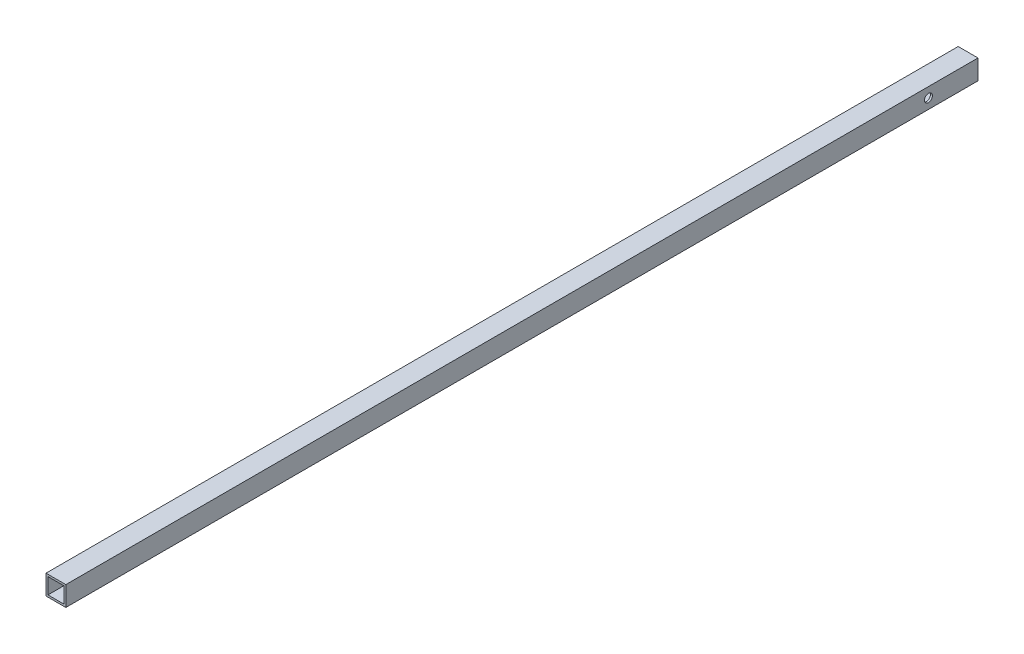
ISO-10303-21;
HEADER;
FILE_DESCRIPTION(('STEP AP214'),'2;1');
FILE_NAME('part.step','',(''),(''),'','','');
FILE_SCHEMA(('AUTOMOTIVE_DESIGN { 1 0 10303 214 1 1 1 1 }'));
ENDSEC;
DATA;
#1=APPLICATION_CONTEXT('core data for automotive mechanical design processes');
#2=APPLICATION_PROTOCOL_DEFINITION('international standard','automotive_design',2000,#1);
#3=PRODUCT_CONTEXT('',#1,'mechanical');
#4=PRODUCT('Part','Part','',(#3));
#5=PRODUCT_RELATED_PRODUCT_CATEGORY('part','',(#4));
#6=PRODUCT_DEFINITION_FORMATION('','',#4);
#7=PRODUCT_DEFINITION_CONTEXT('part definition',#1,'design');
#8=PRODUCT_DEFINITION('design','',#6,#7);
#9=PRODUCT_DEFINITION_SHAPE('','',#8);
#10=(LENGTH_UNIT() NAMED_UNIT(*) SI_UNIT(.MILLI.,.METRE.));
#11=(NAMED_UNIT(*) PLANE_ANGLE_UNIT() SI_UNIT($,.RADIAN.));
#12=(NAMED_UNIT(*) SI_UNIT($,.STERADIAN.) SOLID_ANGLE_UNIT());
#13=UNCERTAINTY_MEASURE_WITH_UNIT(LENGTH_MEASURE(1.E-05),#10,'distance_accuracy_value','');
#14=(GEOMETRIC_REPRESENTATION_CONTEXT(3) GLOBAL_UNCERTAINTY_ASSIGNED_CONTEXT((#13)) GLOBAL_UNIT_ASSIGNED_CONTEXT((#10,
#11,#12)) REPRESENTATION_CONTEXT('',''));
#15=CARTESIAN_POINT('',(0.,0.,0.));
#16=DIRECTION('',(0.,0.,1.));
#17=DIRECTION('',(1.,0.,0.));
#18=AXIS2_PLACEMENT_3D('',#15,#16,#17);
#19=CARTESIAN_POINT('',(-10.,10.,970.));
#20=DIRECTION('',(1.,0.,0.));
#21=DIRECTION('',(0.,0.,-1.));
#22=AXIS2_PLACEMENT_3D('',#19,#20,#21);
#23=PLANE('',#22);
#24=CARTESIAN_POINT('',(-10.,0.,730.));
#25=DIRECTION('',(-1.,0.,0.));
#26=DIRECTION('',(0.,0.,1.));
#27=AXIS2_PLACEMENT_3D('',#24,#25,#26);
#28=CIRCLE('',#27,1.64999999999999);
#29=CARTESIAN_POINT('',(-10.,0.,731.65));
#30=VERTEX_POINT('',#29);
#31=EDGE_CURVE('E167',#30,#30,#28,.T.);
#32=ORIENTED_EDGE('',*,*,#31,.F.);
#33=EDGE_LOOP('',(#32));
#34=FACE_BOUND('',#33,.T.);
#35=DIRECTION('',(0.,0.,-1.));
#36=VECTOR('',#35,1.);
#37=CARTESIAN_POINT('',(-10.,-10.,970.));
#38=LINE('',#37,#36);
#39=CARTESIAN_POINT('',(-10.,-10.,920.));
#40=VERTEX_POINT('',#39);
#41=CARTESIAN_POINT('',(-10.,-10.,0.));
#42=VERTEX_POINT('',#41);
#43=EDGE_CURVE('E141',#40,#42,#38,.T.);
#44=ORIENTED_EDGE('',*,*,#43,.F.);
#45=DIRECTION('',(0.,1.,0.));
#46=VECTOR('',#45,1.);
#47=CARTESIAN_POINT('',(-10.,10.,920.));
#48=LINE('',#47,#46);
#49=CARTESIAN_POINT('',(-10.,10.,920.));
#50=VERTEX_POINT('',#49);
#51=EDGE_CURVE('E51',#40,#50,#48,.T.);
#52=ORIENTED_EDGE('',*,*,#51,.T.);
#53=DIRECTION('',(0.,0.,-1.));
#54=VECTOR('',#53,1.);
#55=CARTESIAN_POINT('',(-10.,10.,970.));
#56=LINE('',#55,#54);
#57=CARTESIAN_POINT('',(-10.,10.,0.));
#58=VERTEX_POINT('',#57);
#59=EDGE_CURVE('E143',#50,#58,#56,.T.);
#60=ORIENTED_EDGE('',*,*,#59,.T.);
#61=DIRECTION('',(0.,-1.,0.));
#62=VECTOR('',#61,1.);
#63=CARTESIAN_POINT('',(-10.,10.,0.));
#64=LINE('',#63,#62);
#65=EDGE_CURVE('E133',#58,#42,#64,.T.);
#66=ORIENTED_EDGE('',*,*,#65,.T.);
#67=EDGE_LOOP('',(#44,#52,#60,#66));
#68=FACE_BOUND('',#67,.T.);
#69=CARTESIAN_POINT('',(-10.,0.,49.9999999999999));
#70=DIRECTION('',(1.,0.,0.));
#71=DIRECTION('',(0.,0.,-1.));
#72=AXIS2_PLACEMENT_3D('',#69,#70,#71);
#73=CIRCLE('',#72,4.05);
#74=CARTESIAN_POINT('',(-10.,0.,45.9499999999999));
#75=VERTEX_POINT('',#74);
#76=EDGE_CURVE('E207',#75,#75,#73,.T.);
#77=ORIENTED_EDGE('',*,*,#76,.T.);
#78=EDGE_LOOP('',(#77));
#79=FACE_BOUND('',#78,.T.);
#80=CARTESIAN_POINT('',(-10.,0.,40.));
#81=DIRECTION('',(1.,0.,0.));
#82=DIRECTION('',(0.,0.,-1.));
#83=AXIS2_PLACEMENT_3D('',#80,#81,#82);
#84=CIRCLE('',#83,1.64999999999999);
#85=CARTESIAN_POINT('',(-10.,0.,38.35));
#86=VERTEX_POINT('',#85);
#87=EDGE_CURVE('E151',#86,#86,#84,.T.);
#88=ORIENTED_EDGE('',*,*,#87,.T.);
#89=EDGE_LOOP('',(#88));
#90=FACE_BOUND('',#89,.T.);
#91=CARTESIAN_POINT('',(-10.,0.,710.));
#92=DIRECTION('',(-1.,0.,0.));
#93=DIRECTION('',(0.,0.,1.));
#94=AXIS2_PLACEMENT_3D('',#91,#92,#93);
#95=CIRCLE('',#94,1.64999999999999);
#96=CARTESIAN_POINT('',(-10.,0.,711.65));
#97=VERTEX_POINT('',#96);
#98=EDGE_CURVE('E157',#97,#97,#95,.T.);
#99=ORIENTED_EDGE('',*,*,#98,.F.);
#100=EDGE_LOOP('',(#99));
#101=FACE_BOUND('',#100,.T.);
#102=ADVANCED_FACE('F34',(#34,#68,#79,#90,#101),#23,.F.);
#103=CARTESIAN_POINT('',(0.,0.,0.));
#104=DIRECTION('',(0.,0.,1.));
#105=DIRECTION('',(1.,0.,0.));
#106=AXIS2_PLACEMENT_3D('',#103,#104,#105);
#107=PLANE('',#106);
#108=DIRECTION('',(0.,1.,0.));
#109=VECTOR('',#108,1.);
#110=CARTESIAN_POINT('',(10.,10.,0.));
#111=LINE('',#110,#109);
#112=CARTESIAN_POINT('',(10.,-10.,0.));
#113=VERTEX_POINT('',#112);
#114=CARTESIAN_POINT('',(10.,10.,0.));
#115=VERTEX_POINT('',#114);
#116=EDGE_CURVE('E127',#113,#115,#111,.T.);
#117=ORIENTED_EDGE('',*,*,#116,.F.);
#118=DIRECTION('',(1.,0.,0.));
#119=VECTOR('',#118,1.);
#120=CARTESIAN_POINT('',(-10.,-10.,0.));
#121=LINE('',#120,#119);
#122=EDGE_CURVE('E136',#42,#113,#121,.T.);
#123=ORIENTED_EDGE('',*,*,#122,.F.);
#124=ORIENTED_EDGE('',*,*,#65,.F.);
#125=DIRECTION('',(-1.,0.,0.));
#126=VECTOR('',#125,1.);
#127=CARTESIAN_POINT('',(-10.,10.,0.));
#128=LINE('',#127,#126);
#129=EDGE_CURVE('E130',#115,#58,#128,.T.);
#130=ORIENTED_EDGE('',*,*,#129,.F.);
#131=EDGE_LOOP('',(#117,#123,#124,#130));
#132=FACE_BOUND('',#131,.T.);
#133=DIRECTION('',(0.,1.,0.));
#134=VECTOR('',#133,1.);
#135=CARTESIAN_POINT('',(8.,8.,0.));
#136=LINE('',#135,#134);
#137=CARTESIAN_POINT('',(8.,-8.,0.));
#138=VERTEX_POINT('',#137);
#139=CARTESIAN_POINT('',(8.,8.,0.));
#140=VERTEX_POINT('',#139);
#141=EDGE_CURVE('E210',#138,#140,#136,.T.);
#142=ORIENTED_EDGE('',*,*,#141,.T.);
#143=DIRECTION('',(-1.,0.,0.));
#144=VECTOR('',#143,1.);
#145=CARTESIAN_POINT('',(-8.,8.,0.));
#146=LINE('',#145,#144);
#147=CARTESIAN_POINT('',(-8.,8.,0.));
#148=VERTEX_POINT('',#147);
#149=EDGE_CURVE('E213',#140,#148,#146,.T.);
#150=ORIENTED_EDGE('',*,*,#149,.T.);
#151=DIRECTION('',(0.,-1.,0.));
#152=VECTOR('',#151,1.);
#153=CARTESIAN_POINT('',(-8.,8.,0.));
#154=LINE('',#153,#152);
#155=CARTESIAN_POINT('',(-8.,-8.,0.));
#156=VERTEX_POINT('',#155);
#157=EDGE_CURVE('E216',#148,#156,#154,.T.);
#158=ORIENTED_EDGE('',*,*,#157,.T.);
#159=DIRECTION('',(1.,0.,0.));
#160=VECTOR('',#159,1.);
#161=CARTESIAN_POINT('',(-8.,-8.,0.));
#162=LINE('',#161,#160);
#163=EDGE_CURVE('E117',#156,#138,#162,.T.);
#164=ORIENTED_EDGE('',*,*,#163,.T.);
#165=EDGE_LOOP('',(#142,#150,#158,#164));
#166=FACE_BOUND('',#165,.T.);
#167=ADVANCED_FACE('F218',(#132,#166),#107,.F.);
#168=CARTESIAN_POINT('',(10.,10.,970.));
#169=DIRECTION('',(-1.,0.,0.));
#170=DIRECTION('',(0.,0.,1.));
#171=AXIS2_PLACEMENT_3D('',#168,#169,#170);
#172=PLANE('',#171);
#173=CARTESIAN_POINT('',(10.,0.,49.9999999999999));
#174=DIRECTION('',(1.,0.,0.));
#175=DIRECTION('',(0.,0.,-1.));
#176=AXIS2_PLACEMENT_3D('',#173,#174,#175);
#177=CIRCLE('',#176,4.05);
#178=CARTESIAN_POINT('',(10.,0.,45.9499999999999));
#179=VERTEX_POINT('',#178);
#180=EDGE_CURVE('E149',#179,#179,#177,.T.);
#181=ORIENTED_EDGE('',*,*,#180,.F.);
#182=EDGE_LOOP('',(#181));
#183=FACE_BOUND('',#182,.T.);
#184=DIRECTION('',(0.,0.,-1.));
#185=VECTOR('',#184,1.);
#186=CARTESIAN_POINT('',(10.,10.,970.));
#187=LINE('',#186,#185);
#188=CARTESIAN_POINT('',(10.,10.,920.));
#189=VERTEX_POINT('',#188);
#190=EDGE_CURVE('E43',#189,#115,#187,.T.);
#191=ORIENTED_EDGE('',*,*,#190,.F.);
#192=DIRECTION('',(0.,-1.,0.));
#193=VECTOR('',#192,1.);
#194=CARTESIAN_POINT('',(10.,10.,920.));
#195=LINE('',#194,#193);
#196=CARTESIAN_POINT('',(10.,-10.,920.));
#197=VERTEX_POINT('',#196);
#198=EDGE_CURVE('E200',#189,#197,#195,.T.);
#199=ORIENTED_EDGE('',*,*,#198,.T.);
#200=DIRECTION('',(0.,0.,-1.));
#201=VECTOR('',#200,1.);
#202=CARTESIAN_POINT('',(10.,-10.,970.));
#203=LINE('',#202,#201);
#204=EDGE_CURVE('E139',#197,#113,#203,.T.);
#205=ORIENTED_EDGE('',*,*,#204,.T.);
#206=ORIENTED_EDGE('',*,*,#116,.T.);
#207=EDGE_LOOP('',(#191,#199,#205,#206));
#208=FACE_BOUND('',#207,.T.);
#209=ADVANCED_FACE('F36',(#183,#208),#172,.F.);
#210=CARTESIAN_POINT('',(-10.,10.,970.));
#211=DIRECTION('',(0.,-1.,0.));
#212=DIRECTION('',(1.,0.,0.));
#213=AXIS2_PLACEMENT_3D('',#210,#211,#212);
#214=PLANE('',#213);
#215=ORIENTED_EDGE('',*,*,#59,.F.);
#216=DIRECTION('',(1.,0.,0.));
#217=VECTOR('',#216,1.);
#218=CARTESIAN_POINT('',(-10.,10.,920.));
#219=LINE('',#218,#217);
#220=EDGE_CURVE('E197',#50,#189,#219,.T.);
#221=ORIENTED_EDGE('',*,*,#220,.T.);
#222=ORIENTED_EDGE('',*,*,#190,.T.);
#223=ORIENTED_EDGE('',*,*,#129,.T.);
#224=EDGE_LOOP('',(#215,#221,#222,#223));
#225=FACE_BOUND('',#224,.T.);
#226=ADVANCED_FACE('F241',(#225),#214,.F.);
#227=CARTESIAN_POINT('',(-10.,-10.,970.));
#228=DIRECTION('',(0.,1.,0.));
#229=DIRECTION('',(0.,0.,1.));
#230=AXIS2_PLACEMENT_3D('',#227,#228,#229);
#231=PLANE('',#230);
#232=CARTESIAN_POINT('',(0.,-10.,650.));
#233=DIRECTION('',(0.,-1.,0.));
#234=DIRECTION('',(0.,0.,-1.));
#235=AXIS2_PLACEMENT_3D('',#232,#233,#234);
#236=CIRCLE('',#235,1.64999999999999);
#237=CARTESIAN_POINT('',(0.,-10.,648.35));
#238=VERTEX_POINT('',#237);
#239=EDGE_CURVE('E153',#238,#238,#236,.T.);
#240=ORIENTED_EDGE('',*,*,#239,.F.);
#241=EDGE_LOOP('',(#240));
#242=FACE_BOUND('',#241,.T.);
#243=CARTESIAN_POINT('',(0.,-10.,670.));
#244=DIRECTION('',(0.,1.,0.));
#245=DIRECTION('',(0.,0.,1.));
#246=AXIS2_PLACEMENT_3D('',#243,#244,#245);
#247=CIRCLE('',#246,1.64999999999999);
#248=CARTESIAN_POINT('',(0.,-10.,671.65));
#249=VERTEX_POINT('',#248);
#250=EDGE_CURVE('E178',#249,#249,#247,.T.);
#251=ORIENTED_EDGE('',*,*,#250,.T.);
#252=EDGE_LOOP('',(#251));
#253=FACE_BOUND('',#252,.T.);
#254=CARTESIAN_POINT('',(0.,-10.,30.));
#255=DIRECTION('',(0.,-1.,0.));
#256=DIRECTION('',(0.,0.,-1.));
#257=AXIS2_PLACEMENT_3D('',#254,#255,#256);
#258=CIRCLE('',#257,1.64999999999999);
#259=CARTESIAN_POINT('',(0.,-10.,28.35));
#260=VERTEX_POINT('',#259);
#261=EDGE_CURVE('E181',#260,#260,#258,.T.);
#262=ORIENTED_EDGE('',*,*,#261,.F.);
#263=EDGE_LOOP('',(#262));
#264=FACE_BOUND('',#263,.T.);
#265=CARTESIAN_POINT('',(0.,-10.,50.));
#266=DIRECTION('',(0.,-1.,0.));
#267=DIRECTION('',(0.,0.,-1.));
#268=AXIS2_PLACEMENT_3D('',#265,#266,#267);
#269=CIRCLE('',#268,1.64999999999999);
#270=CARTESIAN_POINT('',(0.,-10.,48.35));
#271=VERTEX_POINT('',#270);
#272=EDGE_CURVE('E187',#271,#271,#269,.T.);
#273=ORIENTED_EDGE('',*,*,#272,.F.);
#274=EDGE_LOOP('',(#273));
#275=FACE_BOUND('',#274,.T.);
#276=ORIENTED_EDGE('',*,*,#204,.F.);
#277=DIRECTION('',(-1.,0.,0.));
#278=VECTOR('',#277,1.);
#279=CARTESIAN_POINT('',(-10.,-10.,920.));
#280=LINE('',#279,#278);
#281=EDGE_CURVE('E194',#197,#40,#280,.T.);
#282=ORIENTED_EDGE('',*,*,#281,.T.);
#283=ORIENTED_EDGE('',*,*,#43,.T.);
#284=ORIENTED_EDGE('',*,*,#122,.T.);
#285=EDGE_LOOP('',(#276,#282,#283,#284));
#286=FACE_BOUND('',#285,.T.);
#287=ADVANCED_FACE('F228',(#242,#253,#264,#275,#286),#231,.F.);
#288=CARTESIAN_POINT('',(8.,8.,970.));
#289=DIRECTION('',(-1.,0.,0.));
#290=DIRECTION('',(0.,-1.,0.));
#291=AXIS2_PLACEMENT_3D('',#288,#289,#290);
#292=PLANE('',#291);
#293=DIRECTION('',(0.,-1.,0.));
#294=VECTOR('',#293,1.);
#295=CARTESIAN_POINT('',(8.,8.,920.));
#296=LINE('',#295,#294);
#297=CARTESIAN_POINT('',(8.,8.,920.));
#298=VERTEX_POINT('',#297);
#299=CARTESIAN_POINT('',(8.,-8.,920.));
#300=VERTEX_POINT('',#299);
#301=EDGE_CURVE('E58',#298,#300,#296,.T.);
#302=ORIENTED_EDGE('',*,*,#301,.F.);
#303=DIRECTION('',(0.,0.,-1.));
#304=VECTOR('',#303,1.);
#305=CARTESIAN_POINT('',(8.,8.,970.));
#306=LINE('',#305,#304);
#307=EDGE_CURVE('E121',#298,#140,#306,.T.);
#308=ORIENTED_EDGE('',*,*,#307,.T.);
#309=ORIENTED_EDGE('',*,*,#141,.F.);
#310=DIRECTION('',(0.,0.,-1.));
#311=VECTOR('',#310,1.);
#312=CARTESIAN_POINT('',(8.,-8.,970.));
#313=LINE('',#312,#311);
#314=EDGE_CURVE('E119',#300,#138,#313,.T.);
#315=ORIENTED_EDGE('',*,*,#314,.F.);
#316=EDGE_LOOP('',(#302,#308,#309,#315));
#317=FACE_BOUND('',#316,.T.);
#318=CARTESIAN_POINT('',(8.00000000000001,0.,49.9999999999999));
#319=DIRECTION('',(-1.,0.,0.));
#320=DIRECTION('',(0.,-1.,0.));
#321=AXIS2_PLACEMENT_3D('',#318,#319,#320);
#322=CIRCLE('',#321,4.05);
#323=CARTESIAN_POINT('',(8.00000000000001,-4.05,49.9999999999999));
#324=VERTEX_POINT('',#323);
#325=EDGE_CURVE('E148',#324,#324,#322,.T.);
#326=ORIENTED_EDGE('',*,*,#325,.F.);
#327=EDGE_LOOP('',(#326));
#328=FACE_BOUND('',#327,.T.);
#329=ADVANCED_FACE('F225',(#317,#328),#292,.T.);
#330=CARTESIAN_POINT('',(-8.,8.,970.));
#331=DIRECTION('',(0.,-1.,0.));
#332=DIRECTION('',(0.,0.,-1.));
#333=AXIS2_PLACEMENT_3D('',#330,#331,#332);
#334=PLANE('',#333);
#335=DIRECTION('',(1.,0.,0.));
#336=VECTOR('',#335,1.);
#337=CARTESIAN_POINT('',(-8.,8.,920.));
#338=LINE('',#337,#336);
#339=CARTESIAN_POINT('',(-8.,8.,920.));
#340=VERTEX_POINT('',#339);
#341=EDGE_CURVE('E112',#340,#298,#338,.T.);
#342=ORIENTED_EDGE('',*,*,#341,.F.);
#343=DIRECTION('',(0.,0.,-1.));
#344=VECTOR('',#343,1.);
#345=CARTESIAN_POINT('',(-8.,8.,970.));
#346=LINE('',#345,#344);
#347=EDGE_CURVE('E111',#340,#148,#346,.T.);
#348=ORIENTED_EDGE('',*,*,#347,.T.);
#349=ORIENTED_EDGE('',*,*,#149,.F.);
#350=ORIENTED_EDGE('',*,*,#307,.F.);
#351=EDGE_LOOP('',(#342,#348,#349,#350));
#352=FACE_BOUND('',#351,.T.);
#353=ADVANCED_FACE('F223',(#352),#334,.T.);
#354=CARTESIAN_POINT('',(-8.,8.,970.));
#355=DIRECTION('',(1.,0.,0.));
#356=DIRECTION('',(0.,0.,-1.));
#357=AXIS2_PLACEMENT_3D('',#354,#355,#356);
#358=PLANE('',#357);
#359=CARTESIAN_POINT('',(-8.,0.,730.));
#360=DIRECTION('',(1.,0.,0.));
#361=DIRECTION('',(0.,0.,-1.));
#362=AXIS2_PLACEMENT_3D('',#359,#360,#361);
#363=CIRCLE('',#362,1.64999999999999);
#364=CARTESIAN_POINT('',(-8.,0.,728.35));
#365=VERTEX_POINT('',#364);
#366=EDGE_CURVE('E38',#365,#365,#363,.T.);
#367=ORIENTED_EDGE('',*,*,#366,.F.);
#368=EDGE_LOOP('',(#367));
#369=FACE_BOUND('',#368,.T.);
#370=CARTESIAN_POINT('',(-8.,0.,710.));
#371=DIRECTION('',(1.,0.,0.));
#372=DIRECTION('',(0.,0.,-1.));
#373=AXIS2_PLACEMENT_3D('',#370,#371,#372);
#374=CIRCLE('',#373,1.64999999999999);
#375=CARTESIAN_POINT('',(-8.,0.,708.35));
#376=VERTEX_POINT('',#375);
#377=EDGE_CURVE('E155',#376,#376,#374,.T.);
#378=ORIENTED_EDGE('',*,*,#377,.F.);
#379=EDGE_LOOP('',(#378));
#380=FACE_BOUND('',#379,.T.);
#381=CARTESIAN_POINT('',(-8.,0.,40.));
#382=DIRECTION('',(1.,0.,0.));
#383=DIRECTION('',(0.,0.,-1.));
#384=AXIS2_PLACEMENT_3D('',#381,#382,#383);
#385=CIRCLE('',#384,1.64999999999999);
#386=CARTESIAN_POINT('',(-8.,0.,38.35));
#387=VERTEX_POINT('',#386);
#388=EDGE_CURVE('E154',#387,#387,#385,.T.);
#389=ORIENTED_EDGE('',*,*,#388,.F.);
#390=EDGE_LOOP('',(#389));
#391=FACE_BOUND('',#390,.T.);
#392=DIRECTION('',(0.,1.,0.));
#393=VECTOR('',#392,1.);
#394=CARTESIAN_POINT('',(-8.,8.,920.));
#395=LINE('',#394,#393);
#396=CARTESIAN_POINT('',(-8.,-8.,920.));
#397=VERTEX_POINT('',#396);
#398=EDGE_CURVE('E99',#397,#340,#395,.T.);
#399=ORIENTED_EDGE('',*,*,#398,.F.);
#400=DIRECTION('',(0.,0.,-1.));
#401=VECTOR('',#400,1.);
#402=CARTESIAN_POINT('',(-8.,-8.,970.));
#403=LINE('',#402,#401);
#404=EDGE_CURVE('E109',#397,#156,#403,.T.);
#405=ORIENTED_EDGE('',*,*,#404,.T.);
#406=ORIENTED_EDGE('',*,*,#157,.F.);
#407=ORIENTED_EDGE('',*,*,#347,.F.);
#408=EDGE_LOOP('',(#399,#405,#406,#407));
#409=FACE_BOUND('',#408,.T.);
#410=CARTESIAN_POINT('',(-8.00000000000001,0.,49.9999999999999));
#411=DIRECTION('',(1.,0.,0.));
#412=DIRECTION('',(0.,0.,-1.));
#413=AXIS2_PLACEMENT_3D('',#410,#411,#412);
#414=CIRCLE('',#413,4.05);
#415=CARTESIAN_POINT('',(-8.00000000000001,0.,45.9499999999999));
#416=VERTEX_POINT('',#415);
#417=EDGE_CURVE('E146',#416,#416,#414,.T.);
#418=ORIENTED_EDGE('',*,*,#417,.F.);
#419=EDGE_LOOP('',(#418));
#420=FACE_BOUND('',#419,.T.);
#421=ADVANCED_FACE('F106',(#369,#380,#391,#409,#420),#358,.T.);
#422=CARTESIAN_POINT('',(-8.,-8.,970.));
#423=DIRECTION('',(0.,1.,0.));
#424=DIRECTION('',(0.,0.,1.));
#425=AXIS2_PLACEMENT_3D('',#422,#423,#424);
#426=PLANE('',#425);
#427=CARTESIAN_POINT('',(0.,-8.,650.));
#428=DIRECTION('',(0.,1.,0.));
#429=DIRECTION('',(0.,0.,1.));
#430=AXIS2_PLACEMENT_3D('',#427,#428,#429);
#431=CIRCLE('',#430,1.64999999999999);
#432=CARTESIAN_POINT('',(0.,-8.,651.65));
#433=VERTEX_POINT('',#432);
#434=EDGE_CURVE('E172',#433,#433,#431,.T.);
#435=ORIENTED_EDGE('',*,*,#434,.F.);
#436=EDGE_LOOP('',(#435));
#437=FACE_BOUND('',#436,.T.);
#438=CARTESIAN_POINT('',(0.,-8.,670.));
#439=DIRECTION('',(0.,1.,0.));
#440=DIRECTION('',(0.,0.,1.));
#441=AXIS2_PLACEMENT_3D('',#438,#439,#440);
#442=CIRCLE('',#441,1.64999999999999);
#443=CARTESIAN_POINT('',(0.,-8.,671.65));
#444=VERTEX_POINT('',#443);
#445=EDGE_CURVE('E175',#444,#444,#442,.T.);
#446=ORIENTED_EDGE('',*,*,#445,.F.);
#447=EDGE_LOOP('',(#446));
#448=FACE_BOUND('',#447,.T.);
#449=CARTESIAN_POINT('',(0.,-8.,30.));
#450=DIRECTION('',(0.,1.,0.));
#451=DIRECTION('',(0.,0.,1.));
#452=AXIS2_PLACEMENT_3D('',#449,#450,#451);
#453=CIRCLE('',#452,1.64999999999999);
#454=CARTESIAN_POINT('',(0.,-8.,31.65));
#455=VERTEX_POINT('',#454);
#456=EDGE_CURVE('E184',#455,#455,#453,.T.);
#457=ORIENTED_EDGE('',*,*,#456,.F.);
#458=EDGE_LOOP('',(#457));
#459=FACE_BOUND('',#458,.T.);
#460=CARTESIAN_POINT('',(0.,-8.,50.));
#461=DIRECTION('',(0.,1.,0.));
#462=DIRECTION('',(0.,0.,1.));
#463=AXIS2_PLACEMENT_3D('',#460,#461,#462);
#464=CIRCLE('',#463,1.64999999999999);
#465=CARTESIAN_POINT('',(0.,-8.,51.65));
#466=VERTEX_POINT('',#465);
#467=EDGE_CURVE('E113',#466,#466,#464,.T.);
#468=ORIENTED_EDGE('',*,*,#467,.F.);
#469=EDGE_LOOP('',(#468));
#470=FACE_BOUND('',#469,.T.);
#471=DIRECTION('',(-1.,0.,0.));
#472=VECTOR('',#471,1.);
#473=CARTESIAN_POINT('',(-8.,-8.,920.));
#474=LINE('',#473,#472);
#475=EDGE_CURVE('E11',#300,#397,#474,.T.);
#476=ORIENTED_EDGE('',*,*,#475,.F.);
#477=ORIENTED_EDGE('',*,*,#314,.T.);
#478=ORIENTED_EDGE('',*,*,#163,.F.);
#479=ORIENTED_EDGE('',*,*,#404,.F.);
#480=EDGE_LOOP('',(#476,#477,#478,#479));
#481=FACE_BOUND('',#480,.T.);
#482=ADVANCED_FACE('F115',(#437,#448,#459,#470,#481),#426,.T.);
#483=CARTESIAN_POINT('',(-960.,0.,49.9999999999999));
#484=DIRECTION('',(1.,0.,0.));
#485=DIRECTION('',(0.,0.,-1.));
#486=AXIS2_PLACEMENT_3D('',#483,#484,#485);
#487=CYLINDRICAL_SURFACE('',#486,4.05);
#488=ORIENTED_EDGE('',*,*,#417,.T.);
#489=EDGE_LOOP('',(#488));
#490=FACE_BOUND('',#489,.T.);
#491=ORIENTED_EDGE('',*,*,#76,.F.);
#492=EDGE_LOOP('',(#491));
#493=FACE_BOUND('',#492,.T.);
#494=ADVANCED_FACE('F235',(#490,#493),#487,.F.);
#495=ORIENTED_EDGE('',*,*,#325,.T.);
#496=EDGE_LOOP('',(#495));
#497=FACE_BOUND('',#496,.T.);
#498=ORIENTED_EDGE('',*,*,#180,.T.);
#499=EDGE_LOOP('',(#498));
#500=FACE_BOUND('',#499,.T.);
#501=ADVANCED_FACE('F232',(#497,#500),#487,.F.);
#502=CARTESIAN_POINT('',(0.,0.,920.));
#503=DIRECTION('',(0.,0.,-1.));
#504=DIRECTION('',(-1.,0.,0.));
#505=AXIS2_PLACEMENT_3D('',#502,#503,#504);
#506=PLANE('',#505);
#507=ORIENTED_EDGE('',*,*,#301,.T.);
#508=ORIENTED_EDGE('',*,*,#475,.T.);
#509=ORIENTED_EDGE('',*,*,#398,.T.);
#510=ORIENTED_EDGE('',*,*,#341,.T.);
#511=EDGE_LOOP('',(#507,#508,#509,#510));
#512=FACE_BOUND('',#511,.T.);
#513=ORIENTED_EDGE('',*,*,#220,.F.);
#514=ORIENTED_EDGE('',*,*,#51,.F.);
#515=ORIENTED_EDGE('',*,*,#281,.F.);
#516=ORIENTED_EDGE('',*,*,#198,.F.);
#517=EDGE_LOOP('',(#513,#514,#515,#516));
#518=FACE_BOUND('',#517,.T.);
#519=ADVANCED_FACE('F98',(#512,#518),#506,.F.);
#520=CARTESIAN_POINT('',(0.,-10.,50.));
#521=DIRECTION('',(0.,-1.,0.));
#522=DIRECTION('',(0.,0.,-1.));
#523=AXIS2_PLACEMENT_3D('',#520,#521,#522);
#524=CYLINDRICAL_SURFACE('',#523,1.64999999999999);
#525=ORIENTED_EDGE('',*,*,#467,.T.);
#526=EDGE_LOOP('',(#525));
#527=FACE_BOUND('',#526,.T.);
#528=ORIENTED_EDGE('',*,*,#272,.T.);
#529=EDGE_LOOP('',(#528));
#530=FACE_BOUND('',#529,.T.);
#531=ADVANCED_FACE('F256',(#527,#530),#524,.F.);
#532=CARTESIAN_POINT('',(0.,-10.,30.));
#533=DIRECTION('',(0.,-1.,0.));
#534=DIRECTION('',(0.,0.,-1.));
#535=AXIS2_PLACEMENT_3D('',#532,#533,#534);
#536=CYLINDRICAL_SURFACE('',#535,1.64999999999999);
#537=ORIENTED_EDGE('',*,*,#456,.T.);
#538=EDGE_LOOP('',(#537));
#539=FACE_BOUND('',#538,.T.);
#540=ORIENTED_EDGE('',*,*,#261,.T.);
#541=EDGE_LOOP('',(#540));
#542=FACE_BOUND('',#541,.T.);
#543=ADVANCED_FACE('F261',(#539,#542),#536,.F.);
#544=CARTESIAN_POINT('',(0.,-8.,670.));
#545=DIRECTION('',(0.,1.,0.));
#546=DIRECTION('',(0.,0.,1.));
#547=AXIS2_PLACEMENT_3D('',#544,#545,#546);
#548=CYLINDRICAL_SURFACE('',#547,1.64999999999999);
#549=ORIENTED_EDGE('',*,*,#445,.T.);
#550=EDGE_LOOP('',(#549));
#551=FACE_BOUND('',#550,.T.);
#552=ORIENTED_EDGE('',*,*,#250,.F.);
#553=EDGE_LOOP('',(#552));
#554=FACE_BOUND('',#553,.T.);
#555=ADVANCED_FACE('F290',(#551,#554),#548,.F.);
#556=CARTESIAN_POINT('',(0.,-10.,650.));
#557=DIRECTION('',(0.,-1.,0.));
#558=DIRECTION('',(0.,0.,-1.));
#559=AXIS2_PLACEMENT_3D('',#556,#557,#558);
#560=CYLINDRICAL_SURFACE('',#559,1.64999999999999);
#561=ORIENTED_EDGE('',*,*,#434,.T.);
#562=EDGE_LOOP('',(#561));
#563=FACE_BOUND('',#562,.T.);
#564=ORIENTED_EDGE('',*,*,#239,.T.);
#565=EDGE_LOOP('',(#564));
#566=FACE_BOUND('',#565,.T.);
#567=ADVANCED_FACE('F296',(#563,#566),#560,.F.);
#568=CARTESIAN_POINT('',(-8.,0.,40.));
#569=DIRECTION('',(1.,0.,0.));
#570=DIRECTION('',(0.,0.,-1.));
#571=AXIS2_PLACEMENT_3D('',#568,#569,#570);
#572=CYLINDRICAL_SURFACE('',#571,1.64999999999999);
#573=ORIENTED_EDGE('',*,*,#388,.T.);
#574=EDGE_LOOP('',(#573));
#575=FACE_BOUND('',#574,.T.);
#576=ORIENTED_EDGE('',*,*,#87,.F.);
#577=EDGE_LOOP('',(#576));
#578=FACE_BOUND('',#577,.T.);
#579=ADVANCED_FACE('F302',(#575,#578),#572,.F.);
#580=CARTESIAN_POINT('',(-10.,0.,710.));
#581=DIRECTION('',(-1.,0.,0.));
#582=DIRECTION('',(0.,0.,1.));
#583=AXIS2_PLACEMENT_3D('',#580,#581,#582);
#584=CYLINDRICAL_SURFACE('',#583,1.64999999999999);
#585=ORIENTED_EDGE('',*,*,#377,.T.);
#586=EDGE_LOOP('',(#585));
#587=FACE_BOUND('',#586,.T.);
#588=ORIENTED_EDGE('',*,*,#98,.T.);
#589=EDGE_LOOP('',(#588));
#590=FACE_BOUND('',#589,.T.);
#591=ADVANCED_FACE('F306',(#587,#590),#584,.F.);
#592=CARTESIAN_POINT('',(-10.,0.,730.));
#593=DIRECTION('',(-1.,0.,0.));
#594=DIRECTION('',(0.,0.,1.));
#595=AXIS2_PLACEMENT_3D('',#592,#593,#594);
#596=CYLINDRICAL_SURFACE('',#595,1.64999999999999);
#597=ORIENTED_EDGE('',*,*,#366,.T.);
#598=EDGE_LOOP('',(#597));
#599=FACE_BOUND('',#598,.T.);
#600=ORIENTED_EDGE('',*,*,#31,.T.);
#601=EDGE_LOOP('',(#600));
#602=FACE_BOUND('',#601,.T.);
#603=ADVANCED_FACE('F310',(#599,#602),#596,.F.);
#604=CLOSED_SHELL('',(#102,#167,#209,#226,#287,#329,#353,#421,#482,#494,#501,#519,#531,#543,
#555,#567,#579,#591,#603));
#605=MANIFOLD_SOLID_BREP('B2',#604);
#606=ADVANCED_BREP_SHAPE_REPRESENTATION('',(#18,#605),#14);
#607=SHAPE_DEFINITION_REPRESENTATION(#9,#606);
ENDSEC;
END-ISO-10303-21;
